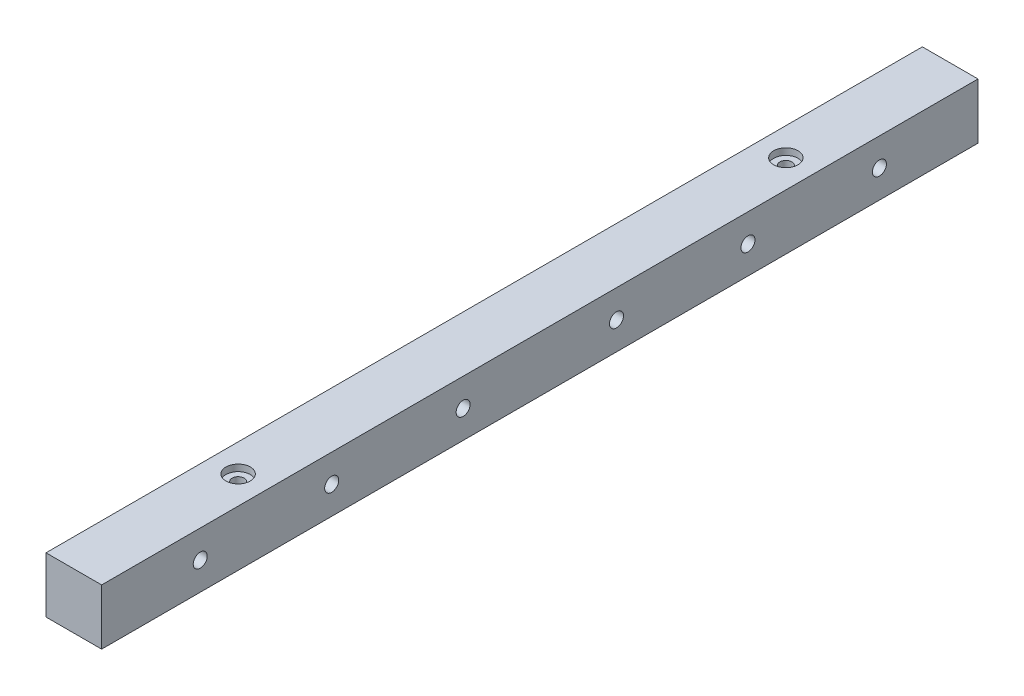
ISO-10303-21;
HEADER;
FILE_DESCRIPTION(('STEP AP214'),'2;1');
FILE_NAME('part.step','',(''),(''),'','','');
FILE_SCHEMA(('AUTOMOTIVE_DESIGN { 1 0 10303 214 1 1 1 1 }'));
ENDSEC;
DATA;
#1=APPLICATION_CONTEXT('core data for automotive mechanical design processes');
#2=APPLICATION_PROTOCOL_DEFINITION('international standard','automotive_design',2000,#1);
#3=PRODUCT_CONTEXT('',#1,'mechanical');
#4=PRODUCT('Part','Part','',(#3));
#5=PRODUCT_RELATED_PRODUCT_CATEGORY('part','',(#4));
#6=PRODUCT_DEFINITION_FORMATION('','',#4);
#7=PRODUCT_DEFINITION_CONTEXT('part definition',#1,'design');
#8=PRODUCT_DEFINITION('design','',#6,#7);
#9=PRODUCT_DEFINITION_SHAPE('','',#8);
#10=(LENGTH_UNIT() NAMED_UNIT(*) SI_UNIT(.MILLI.,.METRE.));
#11=(NAMED_UNIT(*) PLANE_ANGLE_UNIT() SI_UNIT($,.RADIAN.));
#12=(NAMED_UNIT(*) SI_UNIT($,.STERADIAN.) SOLID_ANGLE_UNIT());
#13=UNCERTAINTY_MEASURE_WITH_UNIT(LENGTH_MEASURE(1.E-05),#10,'distance_accuracy_value','');
#14=(GEOMETRIC_REPRESENTATION_CONTEXT(3) GLOBAL_UNCERTAINTY_ASSIGNED_CONTEXT((#13)) GLOBAL_UNIT_ASSIGNED_CONTEXT((#10,
#11,#12)) REPRESENTATION_CONTEXT('',''));
#15=CARTESIAN_POINT('',(0.,0.,0.));
#16=DIRECTION('',(0.,0.,1.));
#17=DIRECTION('',(1.,0.,0.));
#18=AXIS2_PLACEMENT_3D('',#15,#16,#17);
#19=CARTESIAN_POINT('',(-12.7,0.,155.));
#20=DIRECTION('',(1.,0.,0.));
#21=DIRECTION('',(0.,1.,0.));
#22=AXIS2_PLACEMENT_3D('',#19,#20,#21);
#23=CYLINDRICAL_SURFACE('',#22,3.20000000000001);
#24=CARTESIAN_POINT('',(12.7,0.,155.));
#25=DIRECTION('',(1.,0.,0.));
#26=DIRECTION('',(0.,1.,0.));
#27=AXIS2_PLACEMENT_3D('',#24,#25,#26);
#28=CIRCLE('',#27,3.20000000000001);
#29=CARTESIAN_POINT('',(12.7,3.19999999999998,155.));
#30=VERTEX_POINT('',#29);
#31=EDGE_CURVE('E174',#30,#30,#28,.T.);
#32=ORIENTED_EDGE('',*,*,#31,.T.);
#33=EDGE_LOOP('',(#32));
#34=FACE_BOUND('',#33,.T.);
#35=CARTESIAN_POINT('',(-9.7,0.,155.));
#36=DIRECTION('',(-1.,0.,0.));
#37=DIRECTION('',(0.,-1.,0.));
#38=AXIS2_PLACEMENT_3D('',#35,#36,#37);
#39=CIRCLE('',#38,3.20000000000001);
#40=CARTESIAN_POINT('',(-9.7,-3.20000000000004,155.));
#41=VERTEX_POINT('',#40);
#42=EDGE_CURVE('E34',#41,#41,#39,.F.);
#43=ORIENTED_EDGE('',*,*,#42,.F.);
#44=EDGE_LOOP('',(#43));
#45=FACE_BOUND('',#44,.T.);
#46=ADVANCED_FACE('F30',(#34,#45),#23,.F.);
#47=CARTESIAN_POINT('',(-12.7,0.,95.));
#48=DIRECTION('',(1.,0.,0.));
#49=DIRECTION('',(0.,1.,0.));
#50=AXIS2_PLACEMENT_3D('',#47,#48,#49);
#51=CYLINDRICAL_SURFACE('',#50,3.20000000000001);
#52=CARTESIAN_POINT('',(12.7,0.,95.));
#53=DIRECTION('',(1.,0.,0.));
#54=DIRECTION('',(0.,1.,0.));
#55=AXIS2_PLACEMENT_3D('',#52,#53,#54);
#56=CIRCLE('',#55,3.20000000000001);
#57=CARTESIAN_POINT('',(12.7,3.19999999999998,95.));
#58=VERTEX_POINT('',#57);
#59=EDGE_CURVE('E171',#58,#58,#56,.T.);
#60=ORIENTED_EDGE('',*,*,#59,.T.);
#61=EDGE_LOOP('',(#60));
#62=FACE_BOUND('',#61,.T.);
#63=CARTESIAN_POINT('',(-9.7,0.,95.));
#64=DIRECTION('',(-1.,0.,0.));
#65=DIRECTION('',(0.,-1.,0.));
#66=AXIS2_PLACEMENT_3D('',#63,#64,#65);
#67=CIRCLE('',#66,3.20000000000001);
#68=CARTESIAN_POINT('',(-9.7,-3.20000000000004,95.));
#69=VERTEX_POINT('',#68);
#70=EDGE_CURVE('E127',#69,#69,#67,.F.);
#71=ORIENTED_EDGE('',*,*,#70,.F.);
#72=EDGE_LOOP('',(#71));
#73=FACE_BOUND('',#72,.T.);
#74=ADVANCED_FACE('F251',(#62,#73),#51,.F.);
#75=CARTESIAN_POINT('',(-12.7,0.,35.));
#76=DIRECTION('',(1.,0.,0.));
#77=DIRECTION('',(0.,1.,0.));
#78=AXIS2_PLACEMENT_3D('',#75,#76,#77);
#79=CYLINDRICAL_SURFACE('',#78,3.20000000000001);
#80=CARTESIAN_POINT('',(12.7,0.,35.));
#81=DIRECTION('',(1.,0.,0.));
#82=DIRECTION('',(0.,1.,0.));
#83=AXIS2_PLACEMENT_3D('',#80,#81,#82);
#84=CIRCLE('',#83,3.20000000000001);
#85=CARTESIAN_POINT('',(12.7,3.19999999999998,35.));
#86=VERTEX_POINT('',#85);
#87=EDGE_CURVE('E168',#86,#86,#84,.T.);
#88=ORIENTED_EDGE('',*,*,#87,.T.);
#89=EDGE_LOOP('',(#88));
#90=FACE_BOUND('',#89,.T.);
#91=CARTESIAN_POINT('',(-9.7,0.,35.));
#92=DIRECTION('',(-1.,0.,0.));
#93=DIRECTION('',(0.,-1.,0.));
#94=AXIS2_PLACEMENT_3D('',#91,#92,#93);
#95=CIRCLE('',#94,3.20000000000001);
#96=CARTESIAN_POINT('',(-9.7,-3.20000000000004,35.));
#97=VERTEX_POINT('',#96);
#98=EDGE_CURVE('E123',#97,#97,#95,.F.);
#99=ORIENTED_EDGE('',*,*,#98,.F.);
#100=EDGE_LOOP('',(#99));
#101=FACE_BOUND('',#100,.T.);
#102=ADVANCED_FACE('F258',(#90,#101),#79,.F.);
#103=CARTESIAN_POINT('',(-12.7,0.,-35.));
#104=DIRECTION('',(1.,0.,0.));
#105=DIRECTION('',(0.,1.,0.));
#106=AXIS2_PLACEMENT_3D('',#103,#104,#105);
#107=CYLINDRICAL_SURFACE('',#106,3.20000000000001);
#108=CARTESIAN_POINT('',(12.7,0.,-35.));
#109=DIRECTION('',(1.,0.,0.));
#110=DIRECTION('',(0.,1.,0.));
#111=AXIS2_PLACEMENT_3D('',#108,#109,#110);
#112=CIRCLE('',#111,3.20000000000001);
#113=CARTESIAN_POINT('',(12.7,3.19999999999998,-35.));
#114=VERTEX_POINT('',#113);
#115=EDGE_CURVE('E165',#114,#114,#112,.T.);
#116=ORIENTED_EDGE('',*,*,#115,.T.);
#117=EDGE_LOOP('',(#116));
#118=FACE_BOUND('',#117,.T.);
#119=CARTESIAN_POINT('',(-9.7,0.,-35.));
#120=DIRECTION('',(-1.,0.,0.));
#121=DIRECTION('',(0.,-1.,0.));
#122=AXIS2_PLACEMENT_3D('',#119,#120,#121);
#123=CIRCLE('',#122,3.20000000000001);
#124=CARTESIAN_POINT('',(-9.7,-3.20000000000004,-35.));
#125=VERTEX_POINT('',#124);
#126=EDGE_CURVE('E118',#125,#125,#123,.F.);
#127=ORIENTED_EDGE('',*,*,#126,.F.);
#128=EDGE_LOOP('',(#127));
#129=FACE_BOUND('',#128,.T.);
#130=ADVANCED_FACE('F333',(#118,#129),#107,.F.);
#131=CARTESIAN_POINT('',(-12.7,0.,-95.));
#132=DIRECTION('',(1.,0.,0.));
#133=DIRECTION('',(0.,1.,0.));
#134=AXIS2_PLACEMENT_3D('',#131,#132,#133);
#135=CYLINDRICAL_SURFACE('',#134,3.20000000000001);
#136=CARTESIAN_POINT('',(12.7,0.,-95.));
#137=DIRECTION('',(1.,0.,0.));
#138=DIRECTION('',(0.,1.,0.));
#139=AXIS2_PLACEMENT_3D('',#136,#137,#138);
#140=CIRCLE('',#139,3.20000000000001);
#141=CARTESIAN_POINT('',(12.7,3.19999999999998,-95.));
#142=VERTEX_POINT('',#141);
#143=EDGE_CURVE('E162',#142,#142,#140,.T.);
#144=ORIENTED_EDGE('',*,*,#143,.T.);
#145=EDGE_LOOP('',(#144));
#146=FACE_BOUND('',#145,.T.);
#147=CARTESIAN_POINT('',(-9.7,0.,-95.));
#148=DIRECTION('',(-1.,0.,0.));
#149=DIRECTION('',(0.,-1.,0.));
#150=AXIS2_PLACEMENT_3D('',#147,#148,#149);
#151=CIRCLE('',#150,3.20000000000001);
#152=CARTESIAN_POINT('',(-9.7,-3.20000000000004,-95.));
#153=VERTEX_POINT('',#152);
#154=EDGE_CURVE('E113',#153,#153,#151,.F.);
#155=ORIENTED_EDGE('',*,*,#154,.F.);
#156=EDGE_LOOP('',(#155));
#157=FACE_BOUND('',#156,.T.);
#158=ADVANCED_FACE('F315',(#146,#157),#135,.F.);
#159=CARTESIAN_POINT('',(-12.7,0.,-155.));
#160=DIRECTION('',(1.,0.,0.));
#161=DIRECTION('',(0.,1.,0.));
#162=AXIS2_PLACEMENT_3D('',#159,#160,#161);
#163=CYLINDRICAL_SURFACE('',#162,3.20000000000001);
#164=CARTESIAN_POINT('',(12.7,0.,-155.));
#165=DIRECTION('',(1.,0.,0.));
#166=DIRECTION('',(0.,1.,0.));
#167=AXIS2_PLACEMENT_3D('',#164,#165,#166);
#168=CIRCLE('',#167,3.20000000000001);
#169=CARTESIAN_POINT('',(12.7,3.19999999999998,-155.));
#170=VERTEX_POINT('',#169);
#171=EDGE_CURVE('E111',#170,#170,#168,.T.);
#172=ORIENTED_EDGE('',*,*,#171,.T.);
#173=EDGE_LOOP('',(#172));
#174=FACE_BOUND('',#173,.T.);
#175=CARTESIAN_POINT('',(-9.7,0.,-155.));
#176=DIRECTION('',(-1.,0.,0.));
#177=DIRECTION('',(0.,-1.,0.));
#178=AXIS2_PLACEMENT_3D('',#175,#176,#177);
#179=CIRCLE('',#178,3.20000000000001);
#180=CARTESIAN_POINT('',(-9.7,-3.20000000000004,-155.));
#181=VERTEX_POINT('',#180);
#182=EDGE_CURVE('E108',#181,#181,#179,.F.);
#183=ORIENTED_EDGE('',*,*,#182,.F.);
#184=EDGE_LOOP('',(#183));
#185=FACE_BOUND('',#184,.T.);
#186=ADVANCED_FACE('F294',(#174,#185),#163,.F.);
#187=CARTESIAN_POINT('',(12.7,-12.7,-200.));
#188=DIRECTION('',(1.,0.,0.));
#189=DIRECTION('',(0.,1.,0.));
#190=AXIS2_PLACEMENT_3D('',#187,#188,#189);
#191=PLANE('',#190);
#192=ORIENTED_EDGE('',*,*,#171,.F.);
#193=EDGE_LOOP('',(#192));
#194=FACE_BOUND('',#193,.T.);
#195=ORIENTED_EDGE('',*,*,#143,.F.);
#196=EDGE_LOOP('',(#195));
#197=FACE_BOUND('',#196,.T.);
#198=ORIENTED_EDGE('',*,*,#115,.F.);
#199=EDGE_LOOP('',(#198));
#200=FACE_BOUND('',#199,.T.);
#201=ORIENTED_EDGE('',*,*,#87,.F.);
#202=EDGE_LOOP('',(#201));
#203=FACE_BOUND('',#202,.T.);
#204=ORIENTED_EDGE('',*,*,#59,.F.);
#205=EDGE_LOOP('',(#204));
#206=FACE_BOUND('',#205,.T.);
#207=ORIENTED_EDGE('',*,*,#31,.F.);
#208=EDGE_LOOP('',(#207));
#209=FACE_BOUND('',#208,.T.);
#210=DIRECTION('',(0.,0.,1.));
#211=VECTOR('',#210,1.);
#212=CARTESIAN_POINT('',(12.7,12.7,-200.));
#213=LINE('',#212,#211);
#214=CARTESIAN_POINT('',(12.7,12.7,-200.));
#215=VERTEX_POINT('',#214);
#216=CARTESIAN_POINT('',(12.7,12.7,200.));
#217=VERTEX_POINT('',#216);
#218=EDGE_CURVE('E69',#215,#217,#213,.T.);
#219=ORIENTED_EDGE('',*,*,#218,.T.);
#220=DIRECTION('',(0.,1.,0.));
#221=VECTOR('',#220,1.);
#222=CARTESIAN_POINT('',(12.7,-12.7,200.));
#223=LINE('',#222,#221);
#224=CARTESIAN_POINT('',(12.7,-12.7,200.));
#225=VERTEX_POINT('',#224);
#226=EDGE_CURVE('E72',#225,#217,#223,.T.);
#227=ORIENTED_EDGE('',*,*,#226,.F.);
#228=DIRECTION('',(0.,0.,1.));
#229=VECTOR('',#228,1.);
#230=CARTESIAN_POINT('',(12.7,-12.7,-200.));
#231=LINE('',#230,#229);
#232=CARTESIAN_POINT('',(12.7,-12.7,-200.));
#233=VERTEX_POINT('',#232);
#234=EDGE_CURVE('E11',#233,#225,#231,.T.);
#235=ORIENTED_EDGE('',*,*,#234,.F.);
#236=DIRECTION('',(0.,1.,0.));
#237=VECTOR('',#236,1.);
#238=CARTESIAN_POINT('',(12.7,-12.7,-200.));
#239=LINE('',#238,#237);
#240=EDGE_CURVE('E73',#233,#215,#239,.T.);
#241=ORIENTED_EDGE('',*,*,#240,.T.);
#242=EDGE_LOOP('',(#219,#227,#235,#241));
#243=FACE_BOUND('',#242,.T.);
#244=ADVANCED_FACE('F32',(#194,#197,#200,#203,#206,#209,#243),#191,.T.);
#245=CARTESIAN_POINT('',(12.7,-12.7,-200.));
#246=DIRECTION('',(0.,-1.,0.));
#247=DIRECTION('',(0.,0.,-1.));
#248=AXIS2_PLACEMENT_3D('',#245,#246,#247);
#249=PLANE('',#248);
#250=CARTESIAN_POINT('',(0.,-12.7,-125.));
#251=DIRECTION('',(0.,-1.,0.));
#252=DIRECTION('',(0.,0.,-1.));
#253=AXIS2_PLACEMENT_3D('',#250,#251,#252);
#254=CIRCLE('',#253,6.00000000000001);
#255=CARTESIAN_POINT('',(0.,-12.7,-131.));
#256=VERTEX_POINT('',#255);
#257=EDGE_CURVE('E192',#256,#256,#254,.T.);
#258=ORIENTED_EDGE('',*,*,#257,.F.);
#259=EDGE_LOOP('',(#258));
#260=FACE_BOUND('',#259,.T.);
#261=CARTESIAN_POINT('',(0.,-12.7,125.));
#262=DIRECTION('',(0.,1.,0.));
#263=DIRECTION('',(0.,0.,1.));
#264=AXIS2_PLACEMENT_3D('',#261,#262,#263);
#265=CIRCLE('',#264,6.00000000000001);
#266=CARTESIAN_POINT('',(0.,-12.7,131.));
#267=VERTEX_POINT('',#266);
#268=EDGE_CURVE('E91',#267,#267,#265,.T.);
#269=ORIENTED_EDGE('',*,*,#268,.T.);
#270=EDGE_LOOP('',(#269));
#271=FACE_BOUND('',#270,.T.);
#272=ORIENTED_EDGE('',*,*,#234,.T.);
#273=DIRECTION('',(1.,0.,0.));
#274=VECTOR('',#273,1.);
#275=CARTESIAN_POINT('',(12.7,-12.7,200.));
#276=LINE('',#275,#274);
#277=CARTESIAN_POINT('',(-12.7,-12.7,200.));
#278=VERTEX_POINT('',#277);
#279=EDGE_CURVE('E90',#278,#225,#276,.T.);
#280=ORIENTED_EDGE('',*,*,#279,.F.);
#281=DIRECTION('',(0.,0.,1.));
#282=VECTOR('',#281,1.);
#283=CARTESIAN_POINT('',(-12.7,-12.7,-200.));
#284=LINE('',#283,#282);
#285=CARTESIAN_POINT('',(-12.7,-12.7,-200.));
#286=VERTEX_POINT('',#285);
#287=EDGE_CURVE('E39',#286,#278,#284,.T.);
#288=ORIENTED_EDGE('',*,*,#287,.F.);
#289=DIRECTION('',(1.,0.,0.));
#290=VECTOR('',#289,1.);
#291=CARTESIAN_POINT('',(12.7,-12.7,-200.));
#292=LINE('',#291,#290);
#293=EDGE_CURVE('E78',#286,#233,#292,.T.);
#294=ORIENTED_EDGE('',*,*,#293,.T.);
#295=EDGE_LOOP('',(#272,#280,#288,#294));
#296=FACE_BOUND('',#295,.T.);
#297=ADVANCED_FACE('F247',(#260,#271,#296),#249,.T.);
#298=CARTESIAN_POINT('',(-12.7,-12.7,-200.));
#299=DIRECTION('',(-1.,0.,0.));
#300=DIRECTION('',(0.,-1.,0.));
#301=AXIS2_PLACEMENT_3D('',#298,#299,#300);
#302=PLANE('',#301);
#303=CARTESIAN_POINT('',(-12.7,0.,155.));
#304=DIRECTION('',(-1.,0.,0.));
#305=DIRECTION('',(0.,-1.,0.));
#306=AXIS2_PLACEMENT_3D('',#303,#304,#305);
#307=CIRCLE('',#306,3.99999999999999);
#308=CARTESIAN_POINT('',(-12.7,-4.00000000000002,155.));
#309=VERTEX_POINT('',#308);
#310=EDGE_CURVE('E143',#309,#309,#307,.T.);
#311=ORIENTED_EDGE('',*,*,#310,.F.);
#312=EDGE_LOOP('',(#311));
#313=FACE_BOUND('',#312,.T.);
#314=CARTESIAN_POINT('',(-12.7,0.,95.));
#315=DIRECTION('',(-1.,0.,0.));
#316=DIRECTION('',(0.,-1.,0.));
#317=AXIS2_PLACEMENT_3D('',#314,#315,#316);
#318=CIRCLE('',#317,4.00000000000001);
#319=CARTESIAN_POINT('',(-12.7,-4.00000000000003,95.));
#320=VERTEX_POINT('',#319);
#321=EDGE_CURVE('E136',#320,#320,#318,.T.);
#322=ORIENTED_EDGE('',*,*,#321,.F.);
#323=EDGE_LOOP('',(#322));
#324=FACE_BOUND('',#323,.T.);
#325=CARTESIAN_POINT('',(-12.7,0.,35.));
#326=DIRECTION('',(-1.,0.,0.));
#327=DIRECTION('',(0.,-1.,0.));
#328=AXIS2_PLACEMENT_3D('',#325,#326,#327);
#329=CIRCLE('',#328,4.00000000000001);
#330=CARTESIAN_POINT('',(-12.7,-4.00000000000003,35.));
#331=VERTEX_POINT('',#330);
#332=EDGE_CURVE('E129',#331,#331,#329,.T.);
#333=ORIENTED_EDGE('',*,*,#332,.F.);
#334=EDGE_LOOP('',(#333));
#335=FACE_BOUND('',#334,.T.);
#336=CARTESIAN_POINT('',(-12.7,0.,-35.));
#337=DIRECTION('',(-1.,0.,0.));
#338=DIRECTION('',(0.,-1.,0.));
#339=AXIS2_PLACEMENT_3D('',#336,#337,#338);
#340=CIRCLE('',#339,4.);
#341=CARTESIAN_POINT('',(-12.7,-4.00000000000003,-35.));
#342=VERTEX_POINT('',#341);
#343=EDGE_CURVE('E125',#342,#342,#340,.T.);
#344=ORIENTED_EDGE('',*,*,#343,.F.);
#345=EDGE_LOOP('',(#344));
#346=FACE_BOUND('',#345,.T.);
#347=CARTESIAN_POINT('',(-12.7,0.,-95.));
#348=DIRECTION('',(-1.,0.,0.));
#349=DIRECTION('',(0.,-1.,0.));
#350=AXIS2_PLACEMENT_3D('',#347,#348,#349);
#351=CIRCLE('',#350,4.00000000000001);
#352=CARTESIAN_POINT('',(-12.7,-4.00000000000003,-95.));
#353=VERTEX_POINT('',#352);
#354=EDGE_CURVE('E121',#353,#353,#351,.T.);
#355=ORIENTED_EDGE('',*,*,#354,.F.);
#356=EDGE_LOOP('',(#355));
#357=FACE_BOUND('',#356,.T.);
#358=CARTESIAN_POINT('',(-12.7,0.,-155.));
#359=DIRECTION('',(-1.,0.,0.));
#360=DIRECTION('',(0.,-1.,0.));
#361=AXIS2_PLACEMENT_3D('',#358,#359,#360);
#362=CIRCLE('',#361,3.99999999999999);
#363=CARTESIAN_POINT('',(-12.7,-4.00000000000002,-155.));
#364=VERTEX_POINT('',#363);
#365=EDGE_CURVE('E116',#364,#364,#362,.T.);
#366=ORIENTED_EDGE('',*,*,#365,.F.);
#367=EDGE_LOOP('',(#366));
#368=FACE_BOUND('',#367,.T.);
#369=ORIENTED_EDGE('',*,*,#287,.T.);
#370=DIRECTION('',(0.,-1.,0.));
#371=VECTOR('',#370,1.);
#372=CARTESIAN_POINT('',(-12.7,-12.7,200.));
#373=LINE('',#372,#371);
#374=CARTESIAN_POINT('',(-12.7,12.7,200.));
#375=VERTEX_POINT('',#374);
#376=EDGE_CURVE('E86',#375,#278,#373,.T.);
#377=ORIENTED_EDGE('',*,*,#376,.F.);
#378=DIRECTION('',(0.,0.,1.));
#379=VECTOR('',#378,1.);
#380=CARTESIAN_POINT('',(-12.7,12.7,-200.));
#381=LINE('',#380,#379);
#382=CARTESIAN_POINT('',(-12.7,12.7,-200.));
#383=VERTEX_POINT('',#382);
#384=EDGE_CURVE('E77',#383,#375,#381,.T.);
#385=ORIENTED_EDGE('',*,*,#384,.F.);
#386=DIRECTION('',(0.,-1.,0.));
#387=VECTOR('',#386,1.);
#388=CARTESIAN_POINT('',(-12.7,-12.7,-200.));
#389=LINE('',#388,#387);
#390=EDGE_CURVE('E103',#383,#286,#389,.T.);
#391=ORIENTED_EDGE('',*,*,#390,.T.);
#392=EDGE_LOOP('',(#369,#377,#385,#391));
#393=FACE_BOUND('',#392,.T.);
#394=ADVANCED_FACE('F238',(#313,#324,#335,#346,#357,#368,#393),#302,.T.);
#395=CARTESIAN_POINT('',(12.7,12.7,-200.));
#396=DIRECTION('',(0.,1.,0.));
#397=DIRECTION('',(0.,0.,1.));
#398=AXIS2_PLACEMENT_3D('',#395,#396,#397);
#399=PLANE('',#398);
#400=CARTESIAN_POINT('',(0.,12.7,-125.));
#401=DIRECTION('',(0.,-1.,0.));
#402=DIRECTION('',(0.,0.,-1.));
#403=AXIS2_PLACEMENT_3D('',#400,#401,#402);
#404=CIRCLE('',#403,5.55625000000001);
#405=CARTESIAN_POINT('',(0.,12.7,-130.55625));
#406=VERTEX_POINT('',#405);
#407=EDGE_CURVE('E177',#406,#406,#404,.T.);
#408=ORIENTED_EDGE('',*,*,#407,.T.);
#409=EDGE_LOOP('',(#408));
#410=FACE_BOUND('',#409,.T.);
#411=CARTESIAN_POINT('',(0.,12.7,125.));
#412=DIRECTION('',(0.,1.,0.));
#413=DIRECTION('',(0.,0.,1.));
#414=AXIS2_PLACEMENT_3D('',#411,#412,#413);
#415=CIRCLE('',#414,5.55625000000001);
#416=CARTESIAN_POINT('',(0.,12.7,130.55625));
#417=VERTEX_POINT('',#416);
#418=EDGE_CURVE('E195',#417,#417,#415,.T.);
#419=ORIENTED_EDGE('',*,*,#418,.F.);
#420=EDGE_LOOP('',(#419));
#421=FACE_BOUND('',#420,.T.);
#422=ORIENTED_EDGE('',*,*,#384,.T.);
#423=DIRECTION('',(-1.,0.,0.));
#424=VECTOR('',#423,1.);
#425=CARTESIAN_POINT('',(12.7,12.7,200.));
#426=LINE('',#425,#424);
#427=EDGE_CURVE('E81',#217,#375,#426,.T.);
#428=ORIENTED_EDGE('',*,*,#427,.F.);
#429=ORIENTED_EDGE('',*,*,#218,.F.);
#430=DIRECTION('',(-1.,0.,0.));
#431=VECTOR('',#430,1.);
#432=CARTESIAN_POINT('',(12.7,12.7,-200.));
#433=LINE('',#432,#431);
#434=EDGE_CURVE('E101',#215,#383,#433,.T.);
#435=ORIENTED_EDGE('',*,*,#434,.T.);
#436=EDGE_LOOP('',(#422,#428,#429,#435));
#437=FACE_BOUND('',#436,.T.);
#438=ADVANCED_FACE('F82',(#410,#421,#437),#399,.T.);
#439=CARTESIAN_POINT('',(12.7,12.7,-200.));
#440=DIRECTION('',(0.,0.,1.));
#441=DIRECTION('',(1.,0.,0.));
#442=AXIS2_PLACEMENT_3D('',#439,#440,#441);
#443=PLANE('',#442);
#444=ORIENTED_EDGE('',*,*,#240,.F.);
#445=ORIENTED_EDGE('',*,*,#293,.F.);
#446=ORIENTED_EDGE('',*,*,#390,.F.);
#447=ORIENTED_EDGE('',*,*,#434,.F.);
#448=EDGE_LOOP('',(#444,#445,#446,#447));
#449=FACE_BOUND('',#448,.T.);
#450=ADVANCED_FACE('F237',(#449),#443,.F.);
#451=CARTESIAN_POINT('',(12.7,12.7,200.));
#452=DIRECTION('',(0.,0.,1.));
#453=DIRECTION('',(1.,0.,0.));
#454=AXIS2_PLACEMENT_3D('',#451,#452,#453);
#455=PLANE('',#454);
#456=ORIENTED_EDGE('',*,*,#226,.T.);
#457=ORIENTED_EDGE('',*,*,#427,.T.);
#458=ORIENTED_EDGE('',*,*,#376,.T.);
#459=ORIENTED_EDGE('',*,*,#279,.T.);
#460=EDGE_LOOP('',(#456,#457,#458,#459));
#461=FACE_BOUND('',#460,.T.);
#462=ADVANCED_FACE('F89',(#461),#455,.T.);
#463=CARTESIAN_POINT('',(0.,23.5107257186035,125.));
#464=DIRECTION('',(0.,1.,0.));
#465=DIRECTION('',(0.,0.,1.));
#466=AXIS2_PLACEMENT_3D('',#463,#464,#465);
#467=CYLINDRICAL_SURFACE('',#466,6.00000000000001);
#468=ORIENTED_EDGE('',*,*,#268,.F.);
#469=EDGE_LOOP('',(#468));
#470=FACE_BOUND('',#469,.T.);
#471=CARTESIAN_POINT('',(0.,2.3,125.));
#472=DIRECTION('',(0.,1.,0.));
#473=DIRECTION('',(0.,0.,1.));
#474=AXIS2_PLACEMENT_3D('',#471,#472,#473);
#475=CIRCLE('',#474,6.00000000000001);
#476=CARTESIAN_POINT('',(0.,2.3,131.));
#477=VERTEX_POINT('',#476);
#478=EDGE_CURVE('E94',#477,#477,#475,.T.);
#479=ORIENTED_EDGE('',*,*,#478,.T.);
#480=EDGE_LOOP('',(#479));
#481=FACE_BOUND('',#480,.T.);
#482=ADVANCED_FACE('F209',(#470,#481),#467,.F.);
#483=CARTESIAN_POINT('',(0.,4.17638837486628,125.));
#484=DIRECTION('',(0.,-1.,0.));
#485=DIRECTION('',(0.,0.,-1.));
#486=AXIS2_PLACEMENT_3D('',#483,#484,#485);
#487=CONICAL_SURFACE('',#486,2.75,1.0471975511966);
#488=ORIENTED_EDGE('',*,*,#478,.F.);
#489=EDGE_LOOP('',(#488));
#490=FACE_BOUND('',#489,.T.);
#491=CARTESIAN_POINT('',(0.,4.17638837486628,125.));
#492=DIRECTION('',(0.,1.,0.));
#493=DIRECTION('',(0.,0.,1.));
#494=AXIS2_PLACEMENT_3D('',#491,#492,#493);
#495=CIRCLE('',#494,2.75);
#496=CARTESIAN_POINT('',(0.,4.17638837486628,127.75));
#497=VERTEX_POINT('',#496);
#498=EDGE_CURVE('E204',#497,#497,#495,.T.);
#499=ORIENTED_EDGE('',*,*,#498,.T.);
#500=EDGE_LOOP('',(#499));
#501=FACE_BOUND('',#500,.T.);
#502=ADVANCED_FACE('F211',(#490,#501),#487,.F.);
#503=CARTESIAN_POINT('',(0.,23.5107257186035,125.));
#504=DIRECTION('',(0.,1.,0.));
#505=DIRECTION('',(0.,0.,1.));
#506=AXIS2_PLACEMENT_3D('',#503,#504,#505);
#507=CYLINDRICAL_SURFACE('',#506,2.75);
#508=ORIENTED_EDGE('',*,*,#498,.F.);
#509=EDGE_LOOP('',(#508));
#510=FACE_BOUND('',#509,.T.);
#511=CARTESIAN_POINT('',(0.,9.7,125.));
#512=DIRECTION('',(0.,1.,0.));
#513=DIRECTION('',(0.,0.,1.));
#514=AXIS2_PLACEMENT_3D('',#511,#512,#513);
#515=CIRCLE('',#514,2.75);
#516=CARTESIAN_POINT('',(0.,9.7,127.75));
#517=VERTEX_POINT('',#516);
#518=EDGE_CURVE('E201',#517,#517,#515,.T.);
#519=ORIENTED_EDGE('',*,*,#518,.T.);
#520=EDGE_LOOP('',(#519));
#521=FACE_BOUND('',#520,.T.);
#522=ADVANCED_FACE('F214',(#510,#521),#507,.F.);
#523=CARTESIAN_POINT('',(0.,9.7,127.75));
#524=DIRECTION('',(0.,-1.,0.));
#525=DIRECTION('',(0.,0.,-1.));
#526=AXIS2_PLACEMENT_3D('',#523,#524,#525);
#527=PLANE('',#526);
#528=ORIENTED_EDGE('',*,*,#518,.F.);
#529=EDGE_LOOP('',(#528));
#530=FACE_BOUND('',#529,.T.);
#531=CARTESIAN_POINT('',(0.,9.7,125.));
#532=DIRECTION('',(0.,1.,0.));
#533=DIRECTION('',(0.,0.,1.));
#534=AXIS2_PLACEMENT_3D('',#531,#532,#533);
#535=CIRCLE('',#534,5.55625000000001);
#536=CARTESIAN_POINT('',(0.,9.7,130.55625));
#537=VERTEX_POINT('',#536);
#538=EDGE_CURVE('E198',#537,#537,#535,.T.);
#539=ORIENTED_EDGE('',*,*,#538,.T.);
#540=EDGE_LOOP('',(#539));
#541=FACE_BOUND('',#540,.T.);
#542=ADVANCED_FACE('F220',(#530,#541),#527,.F.);
#543=CARTESIAN_POINT('',(0.,23.5107257186035,125.));
#544=DIRECTION('',(0.,1.,0.));
#545=DIRECTION('',(0.,0.,1.));
#546=AXIS2_PLACEMENT_3D('',#543,#544,#545);
#547=CYLINDRICAL_SURFACE('',#546,5.55625000000001);
#548=ORIENTED_EDGE('',*,*,#538,.F.);
#549=EDGE_LOOP('',(#548));
#550=FACE_BOUND('',#549,.T.);
#551=ORIENTED_EDGE('',*,*,#418,.T.);
#552=EDGE_LOOP('',(#551));
#553=FACE_BOUND('',#552,.T.);
#554=ADVANCED_FACE('F226',(#550,#553),#547,.F.);
#555=CARTESIAN_POINT('',(0.,23.5107257186035,-125.));
#556=DIRECTION('',(0.,1.,0.));
#557=DIRECTION('',(0.,0.,-1.));
#558=AXIS2_PLACEMENT_3D('',#555,#556,#557);
#559=CYLINDRICAL_SURFACE('',#558,6.00000000000001);
#560=ORIENTED_EDGE('',*,*,#257,.T.);
#561=EDGE_LOOP('',(#560));
#562=FACE_BOUND('',#561,.T.);
#563=CARTESIAN_POINT('',(0.,2.3,-125.));
#564=DIRECTION('',(0.,-1.,0.));
#565=DIRECTION('',(0.,0.,-1.));
#566=AXIS2_PLACEMENT_3D('',#563,#564,#565);
#567=CIRCLE('',#566,6.00000000000001);
#568=CARTESIAN_POINT('',(0.,2.3,-131.));
#569=VERTEX_POINT('',#568);
#570=EDGE_CURVE('E189',#569,#569,#567,.T.);
#571=ORIENTED_EDGE('',*,*,#570,.F.);
#572=EDGE_LOOP('',(#571));
#573=FACE_BOUND('',#572,.T.);
#574=ADVANCED_FACE('F232',(#562,#573),#559,.F.);
#575=CARTESIAN_POINT('',(0.,4.17638837486628,-125.));
#576=DIRECTION('',(0.,-1.,0.));
#577=DIRECTION('',(0.,0.,1.));
#578=AXIS2_PLACEMENT_3D('',#575,#576,#577);
#579=CONICAL_SURFACE('',#578,2.75,1.0471975511966);
#580=ORIENTED_EDGE('',*,*,#570,.T.);
#581=EDGE_LOOP('',(#580));
#582=FACE_BOUND('',#581,.T.);
#583=CARTESIAN_POINT('',(0.,4.17638837486628,-125.));
#584=DIRECTION('',(0.,-1.,0.));
#585=DIRECTION('',(0.,0.,-1.));
#586=AXIS2_PLACEMENT_3D('',#583,#584,#585);
#587=CIRCLE('',#586,2.75);
#588=CARTESIAN_POINT('',(0.,4.17638837486628,-127.75));
#589=VERTEX_POINT('',#588);
#590=EDGE_CURVE('E186',#589,#589,#587,.T.);
#591=ORIENTED_EDGE('',*,*,#590,.F.);
#592=EDGE_LOOP('',(#591));
#593=FACE_BOUND('',#592,.T.);
#594=ADVANCED_FACE('F275',(#582,#593),#579,.F.);
#595=CARTESIAN_POINT('',(0.,23.5107257186035,-125.));
#596=DIRECTION('',(0.,1.,0.));
#597=DIRECTION('',(0.,0.,-1.));
#598=AXIS2_PLACEMENT_3D('',#595,#596,#597);
#599=CYLINDRICAL_SURFACE('',#598,2.75);
#600=ORIENTED_EDGE('',*,*,#590,.T.);
#601=EDGE_LOOP('',(#600));
#602=FACE_BOUND('',#601,.T.);
#603=CARTESIAN_POINT('',(0.,9.7,-125.));
#604=DIRECTION('',(0.,-1.,0.));
#605=DIRECTION('',(0.,0.,-1.));
#606=AXIS2_PLACEMENT_3D('',#603,#604,#605);
#607=CIRCLE('',#606,2.75);
#608=CARTESIAN_POINT('',(0.,9.7,-127.75));
#609=VERTEX_POINT('',#608);
#610=EDGE_CURVE('E183',#609,#609,#607,.T.);
#611=ORIENTED_EDGE('',*,*,#610,.F.);
#612=EDGE_LOOP('',(#611));
#613=FACE_BOUND('',#612,.T.);
#614=ADVANCED_FACE('F271',(#602,#613),#599,.F.);
#615=CARTESIAN_POINT('',(0.,9.7,-127.75));
#616=DIRECTION('',(0.,-1.,0.));
#617=DIRECTION('',(0.,0.,1.));
#618=AXIS2_PLACEMENT_3D('',#615,#616,#617);
#619=PLANE('',#618);
#620=ORIENTED_EDGE('',*,*,#610,.T.);
#621=EDGE_LOOP('',(#620));
#622=FACE_BOUND('',#621,.T.);
#623=CARTESIAN_POINT('',(0.,9.7,-125.));
#624=DIRECTION('',(0.,-1.,0.));
#625=DIRECTION('',(0.,0.,-1.));
#626=AXIS2_PLACEMENT_3D('',#623,#624,#625);
#627=CIRCLE('',#626,5.55625000000001);
#628=CARTESIAN_POINT('',(0.,9.7,-130.55625));
#629=VERTEX_POINT('',#628);
#630=EDGE_CURVE('E180',#629,#629,#627,.T.);
#631=ORIENTED_EDGE('',*,*,#630,.F.);
#632=EDGE_LOOP('',(#631));
#633=FACE_BOUND('',#632,.T.);
#634=ADVANCED_FACE('F267',(#622,#633),#619,.F.);
#635=CARTESIAN_POINT('',(0.,23.5107257186035,-125.));
#636=DIRECTION('',(0.,1.,0.));
#637=DIRECTION('',(0.,0.,-1.));
#638=AXIS2_PLACEMENT_3D('',#635,#636,#637);
#639=CYLINDRICAL_SURFACE('',#638,5.55625000000001);
#640=ORIENTED_EDGE('',*,*,#630,.T.);
#641=EDGE_LOOP('',(#640));
#642=FACE_BOUND('',#641,.T.);
#643=ORIENTED_EDGE('',*,*,#407,.F.);
#644=EDGE_LOOP('',(#643));
#645=FACE_BOUND('',#644,.T.);
#646=ADVANCED_FACE('F264',(#642,#645),#639,.F.);
#647=CARTESIAN_POINT('',(-9.7,0.,-155.));
#648=DIRECTION('',(-1.,0.,0.));
#649=DIRECTION('',(0.,-1.,0.));
#650=AXIS2_PLACEMENT_3D('',#647,#648,#649);
#651=PLANE('',#650);
#652=CARTESIAN_POINT('',(-9.7,0.,-155.));
#653=DIRECTION('',(-1.,0.,0.));
#654=DIRECTION('',(0.,-1.,0.));
#655=AXIS2_PLACEMENT_3D('',#652,#653,#654);
#656=CIRCLE('',#655,3.99999999999999);
#657=CARTESIAN_POINT('',(-9.7,-4.00000000000002,-155.));
#658=VERTEX_POINT('',#657);
#659=EDGE_CURVE('E112',#658,#658,#656,.T.);
#660=ORIENTED_EDGE('',*,*,#659,.T.);
#661=EDGE_LOOP('',(#660));
#662=FACE_BOUND('',#661,.T.);
#663=ORIENTED_EDGE('',*,*,#182,.T.);
#664=EDGE_LOOP('',(#663));
#665=FACE_BOUND('',#664,.T.);
#666=ADVANCED_FACE('F266',(#662,#665),#651,.T.);
#667=CARTESIAN_POINT('',(-9.7,0.,-155.));
#668=DIRECTION('',(-1.,0.,0.));
#669=DIRECTION('',(0.,-1.,0.));
#670=AXIS2_PLACEMENT_3D('',#667,#668,#669);
#671=CYLINDRICAL_SURFACE('',#670,3.99999999999999);
#672=ORIENTED_EDGE('',*,*,#659,.F.);
#673=EDGE_LOOP('',(#672));
#674=FACE_BOUND('',#673,.T.);
#675=ORIENTED_EDGE('',*,*,#365,.T.);
#676=EDGE_LOOP('',(#675));
#677=FACE_BOUND('',#676,.T.);
#678=ADVANCED_FACE('F363',(#674,#677),#671,.F.);
#679=CARTESIAN_POINT('',(-9.7,0.,-95.));
#680=DIRECTION('',(-1.,0.,0.));
#681=DIRECTION('',(0.,-1.,0.));
#682=AXIS2_PLACEMENT_3D('',#679,#680,#681);
#683=PLANE('',#682);
#684=CARTESIAN_POINT('',(-9.7,0.,-95.));
#685=DIRECTION('',(-1.,0.,0.));
#686=DIRECTION('',(0.,-1.,0.));
#687=AXIS2_PLACEMENT_3D('',#684,#685,#686);
#688=CIRCLE('',#687,4.00000000000001);
#689=CARTESIAN_POINT('',(-9.7,-4.00000000000003,-95.));
#690=VERTEX_POINT('',#689);
#691=EDGE_CURVE('E117',#690,#690,#688,.T.);
#692=ORIENTED_EDGE('',*,*,#691,.T.);
#693=EDGE_LOOP('',(#692));
#694=FACE_BOUND('',#693,.T.);
#695=ORIENTED_EDGE('',*,*,#154,.T.);
#696=EDGE_LOOP('',(#695));
#697=FACE_BOUND('',#696,.T.);
#698=ADVANCED_FACE('F360',(#694,#697),#683,.T.);
#699=CARTESIAN_POINT('',(-9.7,0.,-95.));
#700=DIRECTION('',(-1.,0.,0.));
#701=DIRECTION('',(0.,-1.,0.));
#702=AXIS2_PLACEMENT_3D('',#699,#700,#701);
#703=CYLINDRICAL_SURFACE('',#702,4.00000000000001);
#704=ORIENTED_EDGE('',*,*,#691,.F.);
#705=EDGE_LOOP('',(#704));
#706=FACE_BOUND('',#705,.T.);
#707=ORIENTED_EDGE('',*,*,#354,.T.);
#708=EDGE_LOOP('',(#707));
#709=FACE_BOUND('',#708,.T.);
#710=ADVANCED_FACE('F357',(#706,#709),#703,.F.);
#711=CARTESIAN_POINT('',(-9.7,0.,-35.));
#712=DIRECTION('',(-1.,0.,0.));
#713=DIRECTION('',(0.,-1.,0.));
#714=AXIS2_PLACEMENT_3D('',#711,#712,#713);
#715=PLANE('',#714);
#716=CARTESIAN_POINT('',(-9.7,0.,-35.));
#717=DIRECTION('',(-1.,0.,0.));
#718=DIRECTION('',(0.,-1.,0.));
#719=AXIS2_PLACEMENT_3D('',#716,#717,#718);
#720=CIRCLE('',#719,4.);
#721=CARTESIAN_POINT('',(-9.7,-4.00000000000003,-35.));
#722=VERTEX_POINT('',#721);
#723=EDGE_CURVE('E122',#722,#722,#720,.T.);
#724=ORIENTED_EDGE('',*,*,#723,.T.);
#725=EDGE_LOOP('',(#724));
#726=FACE_BOUND('',#725,.T.);
#727=ORIENTED_EDGE('',*,*,#126,.T.);
#728=EDGE_LOOP('',(#727));
#729=FACE_BOUND('',#728,.T.);
#730=ADVANCED_FACE('F349',(#726,#729),#715,.T.);
#731=CARTESIAN_POINT('',(-9.7,0.,-35.));
#732=DIRECTION('',(-1.,0.,0.));
#733=DIRECTION('',(0.,-1.,0.));
#734=AXIS2_PLACEMENT_3D('',#731,#732,#733);
#735=CYLINDRICAL_SURFACE('',#734,4.);
#736=ORIENTED_EDGE('',*,*,#723,.F.);
#737=EDGE_LOOP('',(#736));
#738=FACE_BOUND('',#737,.T.);
#739=ORIENTED_EDGE('',*,*,#343,.T.);
#740=EDGE_LOOP('',(#739));
#741=FACE_BOUND('',#740,.T.);
#742=ADVANCED_FACE('F339',(#738,#741),#735,.F.);
#743=CARTESIAN_POINT('',(-9.7,0.,35.));
#744=DIRECTION('',(-1.,0.,0.));
#745=DIRECTION('',(0.,-1.,0.));
#746=AXIS2_PLACEMENT_3D('',#743,#744,#745);
#747=PLANE('',#746);
#748=CARTESIAN_POINT('',(-9.7,0.,35.));
#749=DIRECTION('',(-1.,0.,0.));
#750=DIRECTION('',(0.,-1.,0.));
#751=AXIS2_PLACEMENT_3D('',#748,#749,#750);
#752=CIRCLE('',#751,4.00000000000001);
#753=CARTESIAN_POINT('',(-9.7,-4.00000000000003,35.));
#754=VERTEX_POINT('',#753);
#755=EDGE_CURVE('E126',#754,#754,#752,.T.);
#756=ORIENTED_EDGE('',*,*,#755,.T.);
#757=EDGE_LOOP('',(#756));
#758=FACE_BOUND('',#757,.T.);
#759=ORIENTED_EDGE('',*,*,#98,.T.);
#760=EDGE_LOOP('',(#759));
#761=FACE_BOUND('',#760,.T.);
#762=ADVANCED_FACE('F336',(#758,#761),#747,.T.);
#763=CARTESIAN_POINT('',(-9.7,0.,35.));
#764=DIRECTION('',(-1.,0.,0.));
#765=DIRECTION('',(0.,-1.,0.));
#766=AXIS2_PLACEMENT_3D('',#763,#764,#765);
#767=CYLINDRICAL_SURFACE('',#766,4.00000000000001);
#768=ORIENTED_EDGE('',*,*,#755,.F.);
#769=EDGE_LOOP('',(#768));
#770=FACE_BOUND('',#769,.T.);
#771=ORIENTED_EDGE('',*,*,#332,.T.);
#772=EDGE_LOOP('',(#771));
#773=FACE_BOUND('',#772,.T.);
#774=ADVANCED_FACE('F338',(#770,#773),#767,.F.);
#775=CARTESIAN_POINT('',(-9.7,0.,95.));
#776=DIRECTION('',(-1.,0.,0.));
#777=DIRECTION('',(0.,-1.,0.));
#778=AXIS2_PLACEMENT_3D('',#775,#776,#777);
#779=PLANE('',#778);
#780=CARTESIAN_POINT('',(-9.7,0.,95.));
#781=DIRECTION('',(-1.,0.,0.));
#782=DIRECTION('',(0.,-1.,0.));
#783=AXIS2_PLACEMENT_3D('',#780,#781,#782);
#784=CIRCLE('',#783,4.00000000000001);
#785=CARTESIAN_POINT('',(-9.7,-4.00000000000003,95.));
#786=VERTEX_POINT('',#785);
#787=EDGE_CURVE('E130',#786,#786,#784,.T.);
#788=ORIENTED_EDGE('',*,*,#787,.T.);
#789=EDGE_LOOP('',(#788));
#790=FACE_BOUND('',#789,.T.);
#791=ORIENTED_EDGE('',*,*,#70,.T.);
#792=EDGE_LOOP('',(#791));
#793=FACE_BOUND('',#792,.T.);
#794=ADVANCED_FACE('F346',(#790,#793),#779,.T.);
#795=CARTESIAN_POINT('',(-9.7,0.,95.));
#796=DIRECTION('',(-1.,0.,0.));
#797=DIRECTION('',(0.,-1.,0.));
#798=AXIS2_PLACEMENT_3D('',#795,#796,#797);
#799=CYLINDRICAL_SURFACE('',#798,4.00000000000001);
#800=ORIENTED_EDGE('',*,*,#787,.F.);
#801=EDGE_LOOP('',(#800));
#802=FACE_BOUND('',#801,.T.);
#803=ORIENTED_EDGE('',*,*,#321,.T.);
#804=EDGE_LOOP('',(#803));
#805=FACE_BOUND('',#804,.T.);
#806=ADVANCED_FACE('F353',(#802,#805),#799,.F.);
#807=CARTESIAN_POINT('',(-9.7,0.,155.));
#808=DIRECTION('',(-1.,0.,0.));
#809=DIRECTION('',(0.,-1.,0.));
#810=AXIS2_PLACEMENT_3D('',#807,#808,#809);
#811=PLANE('',#810);
#812=CARTESIAN_POINT('',(-9.7,0.,155.));
#813=DIRECTION('',(-1.,0.,0.));
#814=DIRECTION('',(0.,-1.,0.));
#815=AXIS2_PLACEMENT_3D('',#812,#813,#814);
#816=CIRCLE('',#815,3.99999999999999);
#817=CARTESIAN_POINT('',(-9.7,-4.00000000000002,155.));
#818=VERTEX_POINT('',#817);
#819=EDGE_CURVE('E470',#818,#818,#816,.T.);
#820=ORIENTED_EDGE('',*,*,#819,.T.);
#821=EDGE_LOOP('',(#820));
#822=FACE_BOUND('',#821,.T.);
#823=ORIENTED_EDGE('',*,*,#42,.T.);
#824=EDGE_LOOP('',(#823));
#825=FACE_BOUND('',#824,.T.);
#826=ADVANCED_FACE('F444',(#822,#825),#811,.T.);
#827=CARTESIAN_POINT('',(-9.7,0.,155.));
#828=DIRECTION('',(-1.,0.,0.));
#829=DIRECTION('',(0.,-1.,0.));
#830=AXIS2_PLACEMENT_3D('',#827,#828,#829);
#831=CYLINDRICAL_SURFACE('',#830,3.99999999999999);
#832=ORIENTED_EDGE('',*,*,#819,.F.);
#833=EDGE_LOOP('',(#832));
#834=FACE_BOUND('',#833,.T.);
#835=ORIENTED_EDGE('',*,*,#310,.T.);
#836=EDGE_LOOP('',(#835));
#837=FACE_BOUND('',#836,.T.);
#838=ADVANCED_FACE('F453',(#834,#837),#831,.F.);
#839=CLOSED_SHELL('',(#46,#74,#102,#130,#158,#186,#244,#297,#394,#438,#450,#462,#482,#502,#522,
#542,#554,#574,#594,#614,#634,#646,#666,#678,#698,#710,#730,#742,#762,#774,#794,#806,#826,#838));
#840=MANIFOLD_SOLID_BREP('B2',#839);
#841=ADVANCED_BREP_SHAPE_REPRESENTATION('',(#18,#840),#14);
#842=SHAPE_DEFINITION_REPRESENTATION(#9,#841);
ENDSEC;
END-ISO-10303-21;
